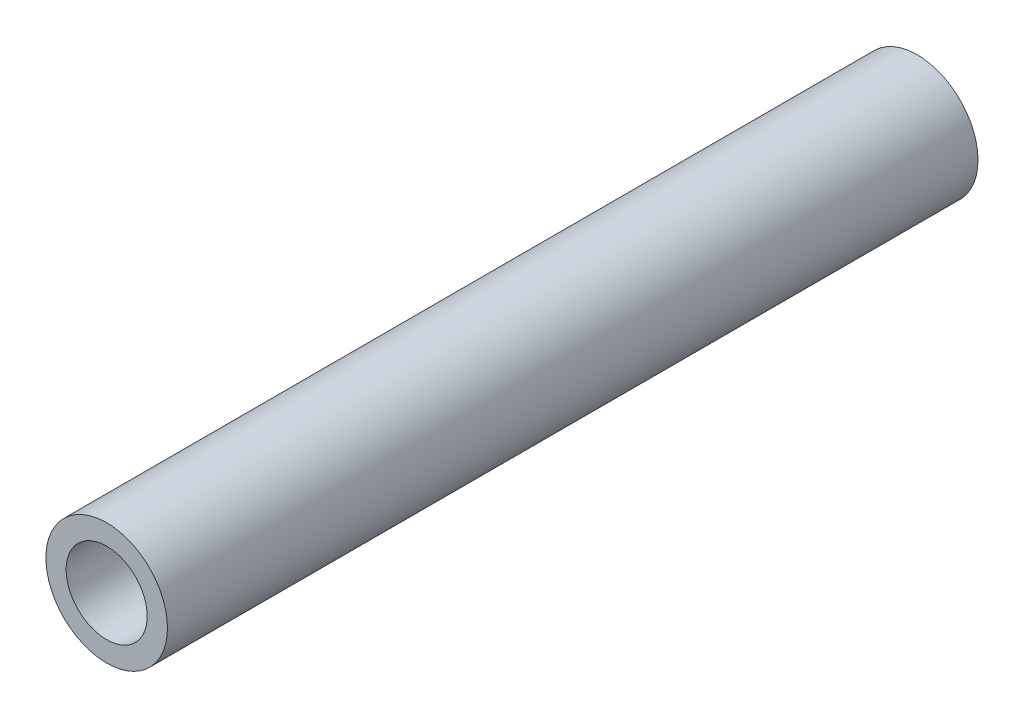
ISO-10303-21;
HEADER;
FILE_DESCRIPTION(('STEP AP214'),'2;1');
FILE_NAME('part.step','',(''),(''),'','','');
FILE_SCHEMA(('AUTOMOTIVE_DESIGN { 1 0 10303 214 1 1 1 1 }'));
ENDSEC;
DATA;
#1=APPLICATION_CONTEXT('core data for automotive mechanical design processes');
#2=APPLICATION_PROTOCOL_DEFINITION('international standard','automotive_design',2000,#1);
#3=PRODUCT_CONTEXT('',#1,'mechanical');
#4=PRODUCT('Part','Part','',(#3));
#5=PRODUCT_RELATED_PRODUCT_CATEGORY('part','',(#4));
#6=PRODUCT_DEFINITION_FORMATION('','',#4);
#7=PRODUCT_DEFINITION_CONTEXT('part definition',#1,'design');
#8=PRODUCT_DEFINITION('design','',#6,#7);
#9=PRODUCT_DEFINITION_SHAPE('','',#8);
#10=(LENGTH_UNIT() NAMED_UNIT(*) SI_UNIT(.MILLI.,.METRE.));
#11=(NAMED_UNIT(*) PLANE_ANGLE_UNIT() SI_UNIT($,.RADIAN.));
#12=(NAMED_UNIT(*) SI_UNIT($,.STERADIAN.) SOLID_ANGLE_UNIT());
#13=UNCERTAINTY_MEASURE_WITH_UNIT(LENGTH_MEASURE(1.E-05),#10,'distance_accuracy_value','');
#14=(GEOMETRIC_REPRESENTATION_CONTEXT(3) GLOBAL_UNCERTAINTY_ASSIGNED_CONTEXT((#13)) GLOBAL_UNIT_ASSIGNED_CONTEXT((#10,
#11,#12)) REPRESENTATION_CONTEXT('',''));
#15=CARTESIAN_POINT('',(0.,0.,0.));
#16=DIRECTION('',(0.,0.,1.));
#17=DIRECTION('',(1.,0.,0.));
#18=AXIS2_PLACEMENT_3D('',#15,#16,#17);
#19=CARTESIAN_POINT('',(0.,0.,101.6));
#20=DIRECTION('',(0.,0.,1.));
#21=DIRECTION('',(1.,0.,0.));
#22=AXIS2_PLACEMENT_3D('',#19,#20,#21);
#23=PLANE('',#22);
#24=CARTESIAN_POINT('',(0.,0.,101.6));
#25=DIRECTION('',(0.,0.,1.));
#26=DIRECTION('',(1.,0.,0.));
#27=AXIS2_PLACEMENT_3D('',#24,#25,#26);
#28=CIRCLE('',#27,7.62);
#29=CARTESIAN_POINT('',(7.62,0.,101.6));
#30=VERTEX_POINT('',#29);
#31=EDGE_CURVE('E10',#30,#30,#28,.T.);
#32=ORIENTED_EDGE('',*,*,#31,.T.);
#33=EDGE_LOOP('',(#32));
#34=FACE_BOUND('',#33,.T.);
#35=CARTESIAN_POINT('',(0.,0.,101.6));
#36=DIRECTION('',(0.,0.,1.));
#37=DIRECTION('',(1.,0.,0.));
#38=AXIS2_PLACEMENT_3D('',#35,#36,#37);
#39=CIRCLE('',#38,5.08);
#40=CARTESIAN_POINT('',(5.08,0.,101.6));
#41=VERTEX_POINT('',#40);
#42=EDGE_CURVE('E44',#41,#41,#39,.T.);
#43=ORIENTED_EDGE('',*,*,#42,.F.);
#44=EDGE_LOOP('',(#43));
#45=FACE_BOUND('',#44,.T.);
#46=ADVANCED_FACE('F33',(#34,#45),#23,.T.);
#47=CARTESIAN_POINT('',(0.,0.,0.));
#48=DIRECTION('',(0.,0.,1.));
#49=DIRECTION('',(1.,0.,0.));
#50=AXIS2_PLACEMENT_3D('',#47,#48,#49);
#51=PLANE('',#50);
#52=CARTESIAN_POINT('',(0.,0.,0.));
#53=DIRECTION('',(0.,0.,1.));
#54=DIRECTION('',(1.,0.,0.));
#55=AXIS2_PLACEMENT_3D('',#52,#53,#54);
#56=CIRCLE('',#55,7.62);
#57=CARTESIAN_POINT('',(7.62,0.,0.));
#58=VERTEX_POINT('',#57);
#59=EDGE_CURVE('E37',#58,#58,#56,.T.);
#60=ORIENTED_EDGE('',*,*,#59,.F.);
#61=EDGE_LOOP('',(#60));
#62=FACE_BOUND('',#61,.T.);
#63=CARTESIAN_POINT('',(0.,0.,0.));
#64=DIRECTION('',(0.,0.,1.));
#65=DIRECTION('',(1.,0.,0.));
#66=AXIS2_PLACEMENT_3D('',#63,#64,#65);
#67=CIRCLE('',#66,5.08);
#68=CARTESIAN_POINT('',(5.08,0.,0.));
#69=VERTEX_POINT('',#68);
#70=EDGE_CURVE('E46',#69,#69,#67,.T.);
#71=ORIENTED_EDGE('',*,*,#70,.T.);
#72=EDGE_LOOP('',(#71));
#73=FACE_BOUND('',#72,.T.);
#74=ADVANCED_FACE('F56',(#62,#73),#51,.F.);
#75=CARTESIAN_POINT('',(0.,0.,101.6));
#76=DIRECTION('',(0.,0.,-1.));
#77=DIRECTION('',(-1.,0.,0.));
#78=AXIS2_PLACEMENT_3D('',#75,#76,#77);
#79=CYLINDRICAL_SURFACE('',#78,7.62);
#80=ORIENTED_EDGE('',*,*,#31,.F.);
#81=EDGE_LOOP('',(#80));
#82=FACE_BOUND('',#81,.T.);
#83=ORIENTED_EDGE('',*,*,#59,.T.);
#84=EDGE_LOOP('',(#83));
#85=FACE_BOUND('',#84,.T.);
#86=ADVANCED_FACE('F35',(#82,#85),#79,.T.);
#87=CARTESIAN_POINT('',(0.,0.,101.6));
#88=DIRECTION('',(0.,0.,-1.));
#89=DIRECTION('',(-1.,0.,0.));
#90=AXIS2_PLACEMENT_3D('',#87,#88,#89);
#91=CYLINDRICAL_SURFACE('',#90,5.08);
#92=ORIENTED_EDGE('',*,*,#42,.T.);
#93=EDGE_LOOP('',(#92));
#94=FACE_BOUND('',#93,.T.);
#95=ORIENTED_EDGE('',*,*,#70,.F.);
#96=EDGE_LOOP('',(#95));
#97=FACE_BOUND('',#96,.T.);
#98=ADVANCED_FACE('F52',(#94,#97),#91,.F.);
#99=CLOSED_SHELL('',(#46,#74,#86,#98));
#100=MANIFOLD_SOLID_BREP('B2',#99);
#101=ADVANCED_BREP_SHAPE_REPRESENTATION('',(#18,#100),#14);
#102=SHAPE_DEFINITION_REPRESENTATION(#9,#101);
ENDSEC;
END-ISO-10303-21;
